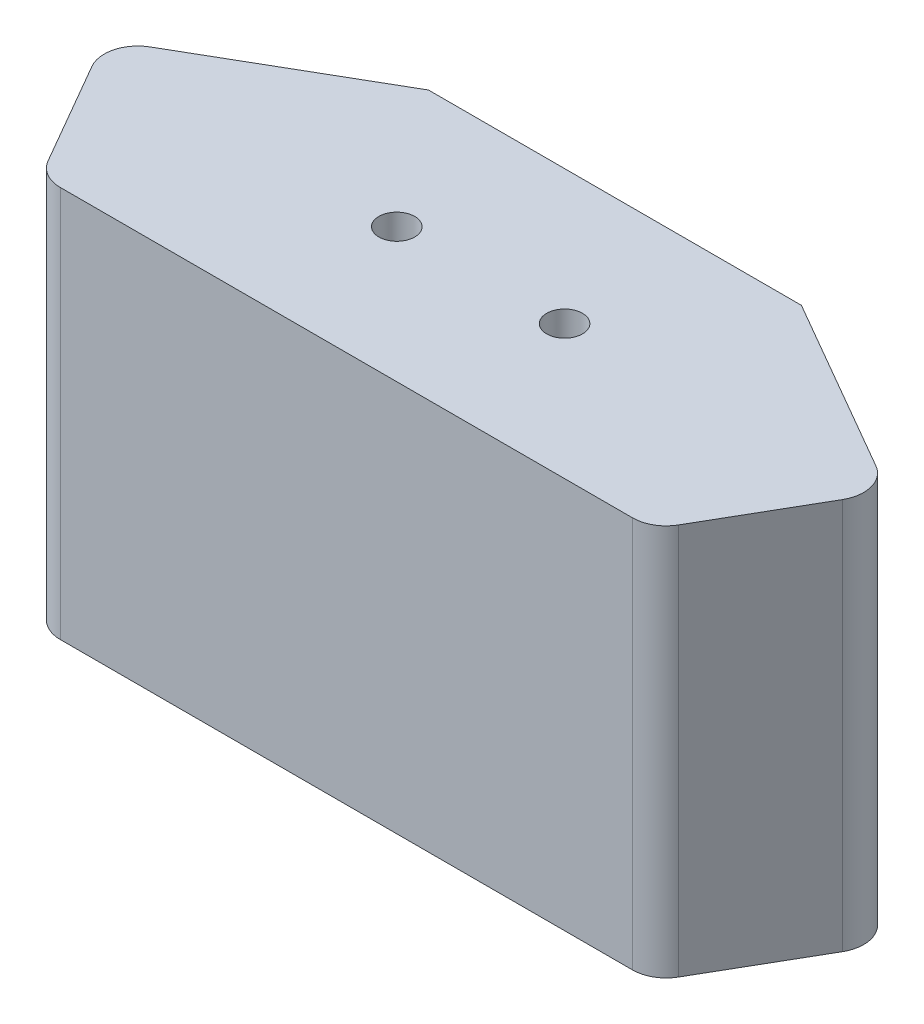
ISO-10303-21;
HEADER;
FILE_DESCRIPTION(('STEP AP214'),'2;1');
FILE_NAME('part.step','',(''),(''),'','','');
FILE_SCHEMA(('AUTOMOTIVE_DESIGN { 1 0 10303 214 1 1 1 1 }'));
ENDSEC;
DATA;
#1=APPLICATION_CONTEXT('core data for automotive mechanical design processes');
#2=APPLICATION_PROTOCOL_DEFINITION('international standard','automotive_design',2000,#1);
#3=PRODUCT_CONTEXT('',#1,'mechanical');
#4=PRODUCT('Part','Part','',(#3));
#5=PRODUCT_RELATED_PRODUCT_CATEGORY('part','',(#4));
#6=PRODUCT_DEFINITION_FORMATION('','',#4);
#7=PRODUCT_DEFINITION_CONTEXT('part definition',#1,'design');
#8=PRODUCT_DEFINITION('design','',#6,#7);
#9=PRODUCT_DEFINITION_SHAPE('','',#8);
#10=(LENGTH_UNIT() NAMED_UNIT(*) SI_UNIT(.MILLI.,.METRE.));
#11=(NAMED_UNIT(*) PLANE_ANGLE_UNIT() SI_UNIT($,.RADIAN.));
#12=(NAMED_UNIT(*) SI_UNIT($,.STERADIAN.) SOLID_ANGLE_UNIT());
#13=UNCERTAINTY_MEASURE_WITH_UNIT(LENGTH_MEASURE(1.E-05),#10,'distance_accuracy_value','');
#14=(GEOMETRIC_REPRESENTATION_CONTEXT(3) GLOBAL_UNCERTAINTY_ASSIGNED_CONTEXT((#13)) GLOBAL_UNIT_ASSIGNED_CONTEXT((#10,
#11,#12)) REPRESENTATION_CONTEXT('',''));
#15=CARTESIAN_POINT('',(0.,0.,0.));
#16=DIRECTION('',(0.,0.,1.));
#17=DIRECTION('',(1.,0.,0.));
#18=AXIS2_PLACEMENT_3D('',#15,#16,#17);
#19=CARTESIAN_POINT('',(41.6666666666667,0.,-20.));
#20=DIRECTION('',(0.,0.,-1.));
#21=DIRECTION('',(-1.,0.,0.));
#22=AXIS2_PLACEMENT_3D('',#19,#20,#21);
#23=PLANE('',#22);
#24=DIRECTION('',(-1.,0.,0.));
#25=VECTOR('',#24,1.);
#26=CARTESIAN_POINT('',(41.6666666666667,35.,-20.));
#27=LINE('',#26,#25);
#28=CARTESIAN_POINT('',(41.6666666666667,35.,-20.));
#29=VERTEX_POINT('',#28);
#30=CARTESIAN_POINT('',(8.33333333333334,35.,-20.));
#31=VERTEX_POINT('',#30);
#32=EDGE_CURVE('E146',#29,#31,#27,.T.);
#33=ORIENTED_EDGE('',*,*,#32,.F.);
#34=DIRECTION('',(0.,1.,0.));
#35=VECTOR('',#34,1.);
#36=CARTESIAN_POINT('',(41.6666666666667,0.,-20.));
#37=LINE('',#36,#35);
#38=CARTESIAN_POINT('',(41.6666666666667,0.,-20.));
#39=VERTEX_POINT('',#38);
#40=EDGE_CURVE('E11',#39,#29,#37,.T.);
#41=ORIENTED_EDGE('',*,*,#40,.F.);
#42=DIRECTION('',(-1.,0.,0.));
#43=VECTOR('',#42,1.);
#44=CARTESIAN_POINT('',(41.6666666666667,0.,-20.));
#45=LINE('',#44,#43);
#46=CARTESIAN_POINT('',(8.33333333333334,0.,-20.));
#47=VERTEX_POINT('',#46);
#48=EDGE_CURVE('E173',#39,#47,#45,.T.);
#49=ORIENTED_EDGE('',*,*,#48,.T.);
#50=DIRECTION('',(0.,1.,0.));
#51=VECTOR('',#50,1.);
#52=CARTESIAN_POINT('',(8.33333333333334,0.,-20.));
#53=LINE('',#52,#51);
#54=EDGE_CURVE('E40',#47,#31,#53,.T.);
#55=ORIENTED_EDGE('',*,*,#54,.T.);
#56=EDGE_LOOP('',(#33,#41,#49,#55));
#57=FACE_BOUND('',#56,.T.);
#58=ADVANCED_FACE('F37',(#57),#23,.T.);
#59=CARTESIAN_POINT('',(57.4429461082955,0.,-10.8915608175649));
#60=DIRECTION('',(0.499999999999998,0.,-0.86602540378444));
#61=DIRECTION('',(-0.86602540378444,0.,-0.499999999999998));
#62=AXIS2_PLACEMENT_3D('',#59,#60,#61);
#63=PLANE('',#62);
#64=DIRECTION('',(-0.86602540378444,0.,-0.499999999999998));
#65=VECTOR('',#64,1.);
#66=CARTESIAN_POINT('',(57.4429461082955,35.,-10.8915608175649));
#67=LINE('',#66,#65);
#68=CARTESIAN_POINT('',(57.4429461082955,35.,-10.8915608175649));
#69=VERTEX_POINT('',#68);
#70=EDGE_CURVE('E171',#69,#29,#67,.T.);
#71=ORIENTED_EDGE('',*,*,#70,.F.);
#72=DIRECTION('',(0.,1.,0.));
#73=VECTOR('',#72,1.);
#74=CARTESIAN_POINT('',(57.4429461082955,0.,-10.8915608175649));
#75=LINE('',#74,#73);
#76=CARTESIAN_POINT('',(57.4429461082955,0.,-10.8915608175649));
#77=VERTEX_POINT('',#76);
#78=EDGE_CURVE('E46',#77,#69,#75,.T.);
#79=ORIENTED_EDGE('',*,*,#78,.F.);
#80=DIRECTION('',(-0.86602540378444,0.,-0.499999999999998));
#81=VECTOR('',#80,1.);
#82=CARTESIAN_POINT('',(57.4429461082955,0.,-10.8915608175649));
#83=LINE('',#82,#81);
#84=EDGE_CURVE('E136',#77,#39,#83,.T.);
#85=ORIENTED_EDGE('',*,*,#84,.T.);
#86=ORIENTED_EDGE('',*,*,#40,.T.);
#87=EDGE_LOOP('',(#71,#79,#85,#86));
#88=FACE_BOUND('',#87,.T.);
#89=ADVANCED_FACE('F189',(#88),#63,.T.);
#90=CARTESIAN_POINT('',(55.9429461082955,0.,-8.29348460621156));
#91=DIRECTION('',(0.,1.,0.));
#92=DIRECTION('',(0.,0.,1.));
#93=AXIS2_PLACEMENT_3D('',#90,#91,#92);
#94=CYLINDRICAL_SURFACE('',#93,2.99999999999999);
#95=CARTESIAN_POINT('',(55.9429461082955,35.,-8.29348460621156));
#96=DIRECTION('',(0.,1.,0.));
#97=DIRECTION('',(0.,0.,1.));
#98=AXIS2_PLACEMENT_3D('',#95,#96,#97);
#99=CIRCLE('',#98,2.99999999999999);
#100=CARTESIAN_POINT('',(58.5410223196488,35.,-6.79348460621156));
#101=VERTEX_POINT('',#100);
#102=EDGE_CURVE('E123',#101,#69,#99,.T.);
#103=ORIENTED_EDGE('',*,*,#102,.F.);
#104=DIRECTION('',(0.,1.,0.));
#105=VECTOR('',#104,1.);
#106=CARTESIAN_POINT('',(58.5410223196488,0.,-6.79348460621156));
#107=LINE('',#106,#105);
#108=CARTESIAN_POINT('',(58.5410223196488,0.,-6.79348460621156));
#109=VERTEX_POINT('',#108);
#110=EDGE_CURVE('E118',#109,#101,#107,.T.);
#111=ORIENTED_EDGE('',*,*,#110,.F.);
#112=CARTESIAN_POINT('',(55.9429461082955,0.,-8.29348460621156));
#113=DIRECTION('',(0.,1.,0.));
#114=DIRECTION('',(0.,0.,1.));
#115=AXIS2_PLACEMENT_3D('',#112,#113,#114);
#116=CIRCLE('',#115,2.99999999999999);
#117=EDGE_CURVE('E121',#109,#77,#116,.T.);
#118=ORIENTED_EDGE('',*,*,#117,.T.);
#119=ORIENTED_EDGE('',*,*,#78,.T.);
#120=EDGE_LOOP('',(#103,#111,#118,#119));
#121=FACE_BOUND('',#120,.T.);
#122=ADVANCED_FACE('F120',(#121),#94,.T.);
#123=CARTESIAN_POINT('',(53.175426480543,0.,2.5));
#124=DIRECTION('',(0.866025403784442,0.,0.499999999999994));
#125=DIRECTION('',(0.499999999999994,0.,-0.866025403784442));
#126=AXIS2_PLACEMENT_3D('',#123,#124,#125);
#127=PLANE('',#126);
#128=DIRECTION('',(0.499999999999994,0.,-0.866025403784442));
#129=VECTOR('',#128,1.);
#130=CARTESIAN_POINT('',(53.175426480543,35.,2.5));
#131=LINE('',#130,#129);
#132=CARTESIAN_POINT('',(53.175426480543,35.,2.49999999999998));
#133=VERTEX_POINT('',#132);
#134=EDGE_CURVE('E168',#133,#101,#131,.T.);
#135=ORIENTED_EDGE('',*,*,#134,.F.);
#136=DIRECTION('',(0.,1.,0.));
#137=VECTOR('',#136,1.);
#138=CARTESIAN_POINT('',(53.175426480543,0.,2.49999999999998));
#139=LINE('',#138,#137);
#140=CARTESIAN_POINT('',(53.175426480543,0.,2.49999999999998));
#141=VERTEX_POINT('',#140);
#142=EDGE_CURVE('E128',#141,#133,#139,.T.);
#143=ORIENTED_EDGE('',*,*,#142,.F.);
#144=DIRECTION('',(0.499999999999994,0.,-0.866025403784442));
#145=VECTOR('',#144,1.);
#146=CARTESIAN_POINT('',(53.175426480543,0.,2.5));
#147=LINE('',#146,#145);
#148=EDGE_CURVE('E134',#141,#109,#147,.T.);
#149=ORIENTED_EDGE('',*,*,#148,.T.);
#150=ORIENTED_EDGE('',*,*,#110,.T.);
#151=EDGE_LOOP('',(#135,#143,#149,#150));
#152=FACE_BOUND('',#151,.T.);
#153=ADVANCED_FACE('F138',(#152),#127,.T.);
#154=CARTESIAN_POINT('',(50.5773502691896,0.,1.));
#155=DIRECTION('',(0.,1.,0.));
#156=DIRECTION('',(0.,0.,1.));
#157=AXIS2_PLACEMENT_3D('',#154,#155,#156);
#158=CYLINDRICAL_SURFACE('',#157,3.00000000000004);
#159=CARTESIAN_POINT('',(50.5773502691896,35.,1.));
#160=DIRECTION('',(0.,1.,0.));
#161=DIRECTION('',(0.,0.,1.));
#162=AXIS2_PLACEMENT_3D('',#159,#160,#161);
#163=CIRCLE('',#162,3.00000000000004);
#164=CARTESIAN_POINT('',(50.5773502691896,35.,4.));
#165=VERTEX_POINT('',#164);
#166=EDGE_CURVE('E165',#165,#133,#163,.T.);
#167=ORIENTED_EDGE('',*,*,#166,.F.);
#168=DIRECTION('',(0.,1.,0.));
#169=VECTOR('',#168,1.);
#170=CARTESIAN_POINT('',(50.5773502691896,0.,4.));
#171=LINE('',#170,#169);
#172=CARTESIAN_POINT('',(50.5773502691896,0.,4.));
#173=VERTEX_POINT('',#172);
#174=EDGE_CURVE('E177',#173,#165,#171,.T.);
#175=ORIENTED_EDGE('',*,*,#174,.F.);
#176=CARTESIAN_POINT('',(50.5773502691896,0.,1.));
#177=DIRECTION('',(0.,1.,0.));
#178=DIRECTION('',(0.,0.,1.));
#179=AXIS2_PLACEMENT_3D('',#176,#177,#178);
#180=CIRCLE('',#179,3.00000000000004);
#181=EDGE_CURVE('E139',#173,#141,#180,.T.);
#182=ORIENTED_EDGE('',*,*,#181,.T.);
#183=ORIENTED_EDGE('',*,*,#142,.T.);
#184=EDGE_LOOP('',(#167,#175,#182,#183));
#185=FACE_BOUND('',#184,.T.);
#186=ADVANCED_FACE('F202',(#185),#158,.T.);
#187=CARTESIAN_POINT('',(-0.577350269189622,0.,4.));
#188=DIRECTION('',(0.,0.,1.));
#189=DIRECTION('',(1.,0.,0.));
#190=AXIS2_PLACEMENT_3D('',#187,#188,#189);
#191=PLANE('',#190);
#192=DIRECTION('',(1.,0.,0.));
#193=VECTOR('',#192,1.);
#194=CARTESIAN_POINT('',(-0.577350269189622,35.,4.));
#195=LINE('',#194,#193);
#196=CARTESIAN_POINT('',(-0.577350269189622,35.,4.));
#197=VERTEX_POINT('',#196);
#198=EDGE_CURVE('E162',#197,#165,#195,.T.);
#199=ORIENTED_EDGE('',*,*,#198,.F.);
#200=DIRECTION('',(0.,1.,0.));
#201=VECTOR('',#200,1.);
#202=CARTESIAN_POINT('',(-0.577350269189622,0.,4.));
#203=LINE('',#202,#201);
#204=CARTESIAN_POINT('',(-0.577350269189622,0.,4.));
#205=VERTEX_POINT('',#204);
#206=EDGE_CURVE('E179',#205,#197,#203,.T.);
#207=ORIENTED_EDGE('',*,*,#206,.F.);
#208=DIRECTION('',(1.,0.,0.));
#209=VECTOR('',#208,1.);
#210=CARTESIAN_POINT('',(-0.577350269189622,0.,4.));
#211=LINE('',#210,#209);
#212=EDGE_CURVE('E141',#205,#173,#211,.T.);
#213=ORIENTED_EDGE('',*,*,#212,.T.);
#214=ORIENTED_EDGE('',*,*,#174,.T.);
#215=EDGE_LOOP('',(#199,#207,#213,#214));
#216=FACE_BOUND('',#215,.T.);
#217=ADVANCED_FACE('F205',(#216),#191,.T.);
#218=CARTESIAN_POINT('',(-0.577350269189622,0.,1.));
#219=DIRECTION('',(0.,1.,0.));
#220=DIRECTION('',(0.,0.,1.));
#221=AXIS2_PLACEMENT_3D('',#218,#219,#220);
#222=CYLINDRICAL_SURFACE('',#221,3.);
#223=CARTESIAN_POINT('',(-0.577350269189622,35.,1.));
#224=DIRECTION('',(0.,1.,0.));
#225=DIRECTION('',(0.,0.,1.));
#226=AXIS2_PLACEMENT_3D('',#223,#224,#225);
#227=CIRCLE('',#226,3.);
#228=CARTESIAN_POINT('',(-3.17542648054293,35.,2.5));
#229=VERTEX_POINT('',#228);
#230=EDGE_CURVE('E159',#229,#197,#227,.T.);
#231=ORIENTED_EDGE('',*,*,#230,.F.);
#232=DIRECTION('',(0.,1.,0.));
#233=VECTOR('',#232,1.);
#234=CARTESIAN_POINT('',(-3.17542648054293,0.,2.5));
#235=LINE('',#234,#233);
#236=CARTESIAN_POINT('',(-3.17542648054293,0.,2.5));
#237=VERTEX_POINT('',#236);
#238=EDGE_CURVE('E181',#237,#229,#235,.T.);
#239=ORIENTED_EDGE('',*,*,#238,.F.);
#240=CARTESIAN_POINT('',(-0.577350269189622,0.,1.));
#241=DIRECTION('',(0.,1.,0.));
#242=DIRECTION('',(0.,0.,1.));
#243=AXIS2_PLACEMENT_3D('',#240,#241,#242);
#244=CIRCLE('',#243,3.);
#245=EDGE_CURVE('E293',#237,#205,#244,.T.);
#246=ORIENTED_EDGE('',*,*,#245,.T.);
#247=ORIENTED_EDGE('',*,*,#206,.T.);
#248=EDGE_LOOP('',(#231,#239,#246,#247));
#249=FACE_BOUND('',#248,.T.);
#250=ADVANCED_FACE('F209',(#249),#222,.T.);
#251=CARTESIAN_POINT('',(-8.5410223196488,0.,-6.79348460621143));
#252=DIRECTION('',(-0.866025403784436,0.,0.500000000000004));
#253=DIRECTION('',(0.500000000000004,0.,0.866025403784436));
#254=AXIS2_PLACEMENT_3D('',#251,#252,#253);
#255=PLANE('',#254);
#256=DIRECTION('',(0.500000000000004,0.,0.866025403784436));
#257=VECTOR('',#256,1.);
#258=CARTESIAN_POINT('',(-8.5410223196488,35.,-6.79348460621143));
#259=LINE('',#258,#257);
#260=CARTESIAN_POINT('',(-8.5410223196488,35.,-6.79348460621143));
#261=VERTEX_POINT('',#260);
#262=EDGE_CURVE('E156',#261,#229,#259,.T.);
#263=ORIENTED_EDGE('',*,*,#262,.F.);
#264=DIRECTION('',(0.,1.,0.));
#265=VECTOR('',#264,1.);
#266=CARTESIAN_POINT('',(-8.5410223196488,0.,-6.79348460621143));
#267=LINE('',#266,#265);
#268=CARTESIAN_POINT('',(-8.5410223196488,0.,-6.79348460621143));
#269=VERTEX_POINT('',#268);
#270=EDGE_CURVE('E183',#269,#261,#267,.T.);
#271=ORIENTED_EDGE('',*,*,#270,.F.);
#272=DIRECTION('',(0.500000000000004,0.,0.866025403784436));
#273=VECTOR('',#272,1.);
#274=CARTESIAN_POINT('',(-8.5410223196488,0.,-6.79348460621143));
#275=LINE('',#274,#273);
#276=EDGE_CURVE('E290',#269,#237,#275,.T.);
#277=ORIENTED_EDGE('',*,*,#276,.T.);
#278=ORIENTED_EDGE('',*,*,#238,.T.);
#279=EDGE_LOOP('',(#263,#271,#277,#278));
#280=FACE_BOUND('',#279,.T.);
#281=ADVANCED_FACE('F213',(#280),#255,.T.);
#282=CARTESIAN_POINT('',(-5.94294610829549,0.,-8.29348460621144));
#283=DIRECTION('',(0.,1.,0.));
#284=DIRECTION('',(0.,0.,1.));
#285=AXIS2_PLACEMENT_3D('',#282,#283,#284);
#286=CYLINDRICAL_SURFACE('',#285,3.);
#287=CARTESIAN_POINT('',(-5.94294610829549,35.,-8.29348460621144));
#288=DIRECTION('',(0.,1.,0.));
#289=DIRECTION('',(0.,0.,1.));
#290=AXIS2_PLACEMENT_3D('',#287,#288,#289);
#291=CIRCLE('',#290,3.);
#292=CARTESIAN_POINT('',(-7.4429461082955,35.,-10.8915608175647));
#293=VERTEX_POINT('',#292);
#294=EDGE_CURVE('E153',#293,#261,#291,.T.);
#295=ORIENTED_EDGE('',*,*,#294,.F.);
#296=DIRECTION('',(0.,1.,0.));
#297=VECTOR('',#296,1.);
#298=CARTESIAN_POINT('',(-7.4429461082955,0.,-10.8915608175647));
#299=LINE('',#298,#297);
#300=CARTESIAN_POINT('',(-7.4429461082955,0.,-10.8915608175647));
#301=VERTEX_POINT('',#300);
#302=EDGE_CURVE('E184',#301,#293,#299,.T.);
#303=ORIENTED_EDGE('',*,*,#302,.F.);
#304=CARTESIAN_POINT('',(-5.94294610829549,0.,-8.29348460621144));
#305=DIRECTION('',(0.,1.,0.));
#306=DIRECTION('',(0.,0.,1.));
#307=AXIS2_PLACEMENT_3D('',#304,#305,#306);
#308=CIRCLE('',#307,3.);
#309=EDGE_CURVE('E287',#301,#269,#308,.T.);
#310=ORIENTED_EDGE('',*,*,#309,.T.);
#311=ORIENTED_EDGE('',*,*,#270,.T.);
#312=EDGE_LOOP('',(#295,#303,#310,#311));
#313=FACE_BOUND('',#312,.T.);
#314=ADVANCED_FACE('F217',(#313),#286,.T.);
#315=CARTESIAN_POINT('',(8.33333333333334,0.,-20.));
#316=DIRECTION('',(-0.500000000000004,0.,-0.866025403784436));
#317=DIRECTION('',(-0.866025403784437,0.,0.500000000000004));
#318=AXIS2_PLACEMENT_3D('',#315,#316,#317);
#319=PLANE('',#318);
#320=DIRECTION('',(-0.866025403784436,0.,0.500000000000004));
#321=VECTOR('',#320,1.);
#322=CARTESIAN_POINT('',(8.33333333333334,35.,-20.));
#323=LINE('',#322,#321);
#324=EDGE_CURVE('E149',#31,#293,#323,.T.);
#325=ORIENTED_EDGE('',*,*,#324,.F.);
#326=ORIENTED_EDGE('',*,*,#54,.F.);
#327=DIRECTION('',(-0.866025403784436,0.,0.500000000000004));
#328=VECTOR('',#327,1.);
#329=CARTESIAN_POINT('',(8.33333333333334,0.,-20.));
#330=LINE('',#329,#328);
#331=EDGE_CURVE('E285',#47,#301,#330,.T.);
#332=ORIENTED_EDGE('',*,*,#331,.T.);
#333=ORIENTED_EDGE('',*,*,#302,.T.);
#334=EDGE_LOOP('',(#325,#326,#332,#333));
#335=FACE_BOUND('',#334,.T.);
#336=ADVANCED_FACE('F186',(#335),#319,.T.);
#337=CARTESIAN_POINT('',(-5.94294610829549,0.,-8.29348460621144));
#338=DIRECTION('',(0.,1.,0.));
#339=DIRECTION('',(0.,0.,1.));
#340=AXIS2_PLACEMENT_3D('',#337,#338,#339);
#341=PLANE('',#340);
#342=CARTESIAN_POINT('',(17.5,0.,-8.));
#343=DIRECTION('',(0.,-1.,0.));
#344=DIRECTION('',(0.,0.,-1.));
#345=AXIS2_PLACEMENT_3D('',#342,#343,#344);
#346=CIRCLE('',#345,3.3);
#347=CARTESIAN_POINT('',(17.5,0.,-11.3));
#348=VERTEX_POINT('',#347);
#349=EDGE_CURVE('E263',#348,#348,#346,.T.);
#350=ORIENTED_EDGE('',*,*,#349,.F.);
#351=EDGE_LOOP('',(#350));
#352=FACE_BOUND('',#351,.T.);
#353=CARTESIAN_POINT('',(32.5,0.,-8.));
#354=DIRECTION('',(0.,-1.,0.));
#355=DIRECTION('',(0.,0.,-1.));
#356=AXIS2_PLACEMENT_3D('',#353,#354,#355);
#357=CIRCLE('',#356,3.3);
#358=CARTESIAN_POINT('',(32.5,0.,-11.3));
#359=VERTEX_POINT('',#358);
#360=EDGE_CURVE('E273',#359,#359,#357,.T.);
#361=ORIENTED_EDGE('',*,*,#360,.F.);
#362=EDGE_LOOP('',(#361));
#363=FACE_BOUND('',#362,.T.);
#364=ORIENTED_EDGE('',*,*,#48,.F.);
#365=ORIENTED_EDGE('',*,*,#84,.F.);
#366=ORIENTED_EDGE('',*,*,#117,.F.);
#367=ORIENTED_EDGE('',*,*,#148,.F.);
#368=ORIENTED_EDGE('',*,*,#181,.F.);
#369=ORIENTED_EDGE('',*,*,#212,.F.);
#370=ORIENTED_EDGE('',*,*,#245,.F.);
#371=ORIENTED_EDGE('',*,*,#276,.F.);
#372=ORIENTED_EDGE('',*,*,#309,.F.);
#373=ORIENTED_EDGE('',*,*,#331,.F.);
#374=EDGE_LOOP('',(#364,#365,#366,#367,#368,#369,#370,#371,#372,#373));
#375=FACE_BOUND('',#374,.T.);
#376=ADVANCED_FACE('F132',(#352,#363,#375),#341,.F.);
#377=CARTESIAN_POINT('',(-5.94294610829549,35.,-8.29348460621144));
#378=DIRECTION('',(0.,1.,0.));
#379=DIRECTION('',(0.,0.,1.));
#380=AXIS2_PLACEMENT_3D('',#377,#378,#379);
#381=PLANE('',#380);
#382=CARTESIAN_POINT('',(17.5,35.,-8.));
#383=DIRECTION('',(0.,-1.,0.));
#384=DIRECTION('',(0.,0.,-1.));
#385=AXIS2_PLACEMENT_3D('',#382,#383,#384);
#386=CIRCLE('',#385,1.6);
#387=CARTESIAN_POINT('',(17.5,35.,-9.6));
#388=VERTEX_POINT('',#387);
#389=EDGE_CURVE('E270',#388,#388,#386,.T.);
#390=ORIENTED_EDGE('',*,*,#389,.T.);
#391=EDGE_LOOP('',(#390));
#392=FACE_BOUND('',#391,.T.);
#393=CARTESIAN_POINT('',(32.5,35.,-8.));
#394=DIRECTION('',(0.,-1.,0.));
#395=DIRECTION('',(0.,0.,-1.));
#396=AXIS2_PLACEMENT_3D('',#393,#394,#395);
#397=CIRCLE('',#396,1.6);
#398=CARTESIAN_POINT('',(32.5,35.,-9.6));
#399=VERTEX_POINT('',#398);
#400=EDGE_CURVE('E150',#399,#399,#397,.T.);
#401=ORIENTED_EDGE('',*,*,#400,.T.);
#402=EDGE_LOOP('',(#401));
#403=FACE_BOUND('',#402,.T.);
#404=ORIENTED_EDGE('',*,*,#32,.T.);
#405=ORIENTED_EDGE('',*,*,#324,.T.);
#406=ORIENTED_EDGE('',*,*,#294,.T.);
#407=ORIENTED_EDGE('',*,*,#262,.T.);
#408=ORIENTED_EDGE('',*,*,#230,.T.);
#409=ORIENTED_EDGE('',*,*,#198,.T.);
#410=ORIENTED_EDGE('',*,*,#166,.T.);
#411=ORIENTED_EDGE('',*,*,#134,.T.);
#412=ORIENTED_EDGE('',*,*,#102,.T.);
#413=ORIENTED_EDGE('',*,*,#70,.T.);
#414=EDGE_LOOP('',(#404,#405,#406,#407,#408,#409,#410,#411,#412,#413));
#415=FACE_BOUND('',#414,.T.);
#416=ADVANCED_FACE('F188',(#392,#403,#415),#381,.T.);
#417=CARTESIAN_POINT('',(32.5,0.,-8.));
#418=DIRECTION('',(0.,-1.,0.));
#419=DIRECTION('',(0.,0.,-1.));
#420=AXIS2_PLACEMENT_3D('',#417,#418,#419);
#421=CYLINDRICAL_SURFACE('',#420,1.6);
#422=ORIENTED_EDGE('',*,*,#400,.F.);
#423=EDGE_LOOP('',(#422));
#424=FACE_BOUND('',#423,.T.);
#425=CARTESIAN_POINT('',(32.5,28.7,-8.));
#426=DIRECTION('',(0.,-1.,0.));
#427=DIRECTION('',(0.,0.,-1.));
#428=AXIS2_PLACEMENT_3D('',#425,#426,#427);
#429=CIRCLE('',#428,1.6);
#430=CARTESIAN_POINT('',(32.5,28.7,-9.6));
#431=VERTEX_POINT('',#430);
#432=EDGE_CURVE('E279',#431,#431,#429,.T.);
#433=ORIENTED_EDGE('',*,*,#432,.T.);
#434=EDGE_LOOP('',(#433));
#435=FACE_BOUND('',#434,.T.);
#436=ADVANCED_FACE('F229',(#424,#435),#421,.F.);
#437=CARTESIAN_POINT('',(32.5,27.,-8.));
#438=DIRECTION('',(0.,-1.,0.));
#439=DIRECTION('',(0.,0.,-1.));
#440=AXIS2_PLACEMENT_3D('',#437,#438,#439);
#441=CONICAL_SURFACE('',#440,3.3,0.785398163397448);
#442=ORIENTED_EDGE('',*,*,#432,.F.);
#443=EDGE_LOOP('',(#442));
#444=FACE_BOUND('',#443,.T.);
#445=CARTESIAN_POINT('',(32.5,27.,-8.));
#446=DIRECTION('',(0.,-1.,0.));
#447=DIRECTION('',(0.,0.,-1.));
#448=AXIS2_PLACEMENT_3D('',#445,#446,#447);
#449=CIRCLE('',#448,3.3);
#450=CARTESIAN_POINT('',(32.5,27.,-11.3));
#451=VERTEX_POINT('',#450);
#452=EDGE_CURVE('E276',#451,#451,#449,.T.);
#453=ORIENTED_EDGE('',*,*,#452,.T.);
#454=EDGE_LOOP('',(#453));
#455=FACE_BOUND('',#454,.T.);
#456=ADVANCED_FACE('F236',(#444,#455),#441,.F.);
#457=CARTESIAN_POINT('',(32.5,0.,-8.));
#458=DIRECTION('',(0.,-1.,0.));
#459=DIRECTION('',(0.,0.,-1.));
#460=AXIS2_PLACEMENT_3D('',#457,#458,#459);
#461=CYLINDRICAL_SURFACE('',#460,3.3);
#462=ORIENTED_EDGE('',*,*,#452,.F.);
#463=EDGE_LOOP('',(#462));
#464=FACE_BOUND('',#463,.T.);
#465=ORIENTED_EDGE('',*,*,#360,.T.);
#466=EDGE_LOOP('',(#465));
#467=FACE_BOUND('',#466,.T.);
#468=ADVANCED_FACE('F240',(#464,#467),#461,.F.);
#469=CARTESIAN_POINT('',(17.5,0.,-8.));
#470=DIRECTION('',(0.,-1.,0.));
#471=DIRECTION('',(0.,0.,-1.));
#472=AXIS2_PLACEMENT_3D('',#469,#470,#471);
#473=CYLINDRICAL_SURFACE('',#472,1.6);
#474=ORIENTED_EDGE('',*,*,#389,.F.);
#475=EDGE_LOOP('',(#474));
#476=FACE_BOUND('',#475,.T.);
#477=CARTESIAN_POINT('',(17.5,28.7,-8.));
#478=DIRECTION('',(0.,-1.,0.));
#479=DIRECTION('',(0.,0.,-1.));
#480=AXIS2_PLACEMENT_3D('',#477,#478,#479);
#481=CIRCLE('',#480,1.6);
#482=CARTESIAN_POINT('',(17.5,28.7,-9.6));
#483=VERTEX_POINT('',#482);
#484=EDGE_CURVE('E265',#483,#483,#481,.T.);
#485=ORIENTED_EDGE('',*,*,#484,.T.);
#486=EDGE_LOOP('',(#485));
#487=FACE_BOUND('',#486,.T.);
#488=ADVANCED_FACE('F244',(#476,#487),#473,.F.);
#489=CARTESIAN_POINT('',(17.5,27.,-8.));
#490=DIRECTION('',(0.,-1.,0.));
#491=DIRECTION('',(0.,0.,-1.));
#492=AXIS2_PLACEMENT_3D('',#489,#490,#491);
#493=CONICAL_SURFACE('',#492,3.3,0.785398163397448);
#494=ORIENTED_EDGE('',*,*,#484,.F.);
#495=EDGE_LOOP('',(#494));
#496=FACE_BOUND('',#495,.T.);
#497=CARTESIAN_POINT('',(17.5,27.,-8.));
#498=DIRECTION('',(0.,-1.,0.));
#499=DIRECTION('',(0.,0.,-1.));
#500=AXIS2_PLACEMENT_3D('',#497,#498,#499);
#501=CIRCLE('',#500,3.3);
#502=CARTESIAN_POINT('',(17.5,27.,-11.3));
#503=VERTEX_POINT('',#502);
#504=EDGE_CURVE('E261',#503,#503,#501,.T.);
#505=ORIENTED_EDGE('',*,*,#504,.T.);
#506=EDGE_LOOP('',(#505));
#507=FACE_BOUND('',#506,.T.);
#508=ADVANCED_FACE('F248',(#496,#507),#493,.F.);
#509=CARTESIAN_POINT('',(17.5,0.,-8.));
#510=DIRECTION('',(0.,-1.,0.));
#511=DIRECTION('',(0.,0.,-1.));
#512=AXIS2_PLACEMENT_3D('',#509,#510,#511);
#513=CYLINDRICAL_SURFACE('',#512,3.3);
#514=ORIENTED_EDGE('',*,*,#504,.F.);
#515=EDGE_LOOP('',(#514));
#516=FACE_BOUND('',#515,.T.);
#517=ORIENTED_EDGE('',*,*,#349,.T.);
#518=EDGE_LOOP('',(#517));
#519=FACE_BOUND('',#518,.T.);
#520=ADVANCED_FACE('F252',(#516,#519),#513,.F.);
#521=CLOSED_SHELL('',(#58,#89,#122,#153,#186,#217,#250,#281,#314,#336,#376,#416,#436,#456,#468,
#488,#508,#520));
#522=MANIFOLD_SOLID_BREP('B2',#521);
#523=ADVANCED_BREP_SHAPE_REPRESENTATION('',(#18,#522),#14);
#524=SHAPE_DEFINITION_REPRESENTATION(#9,#523);
ENDSEC;
END-ISO-10303-21;
